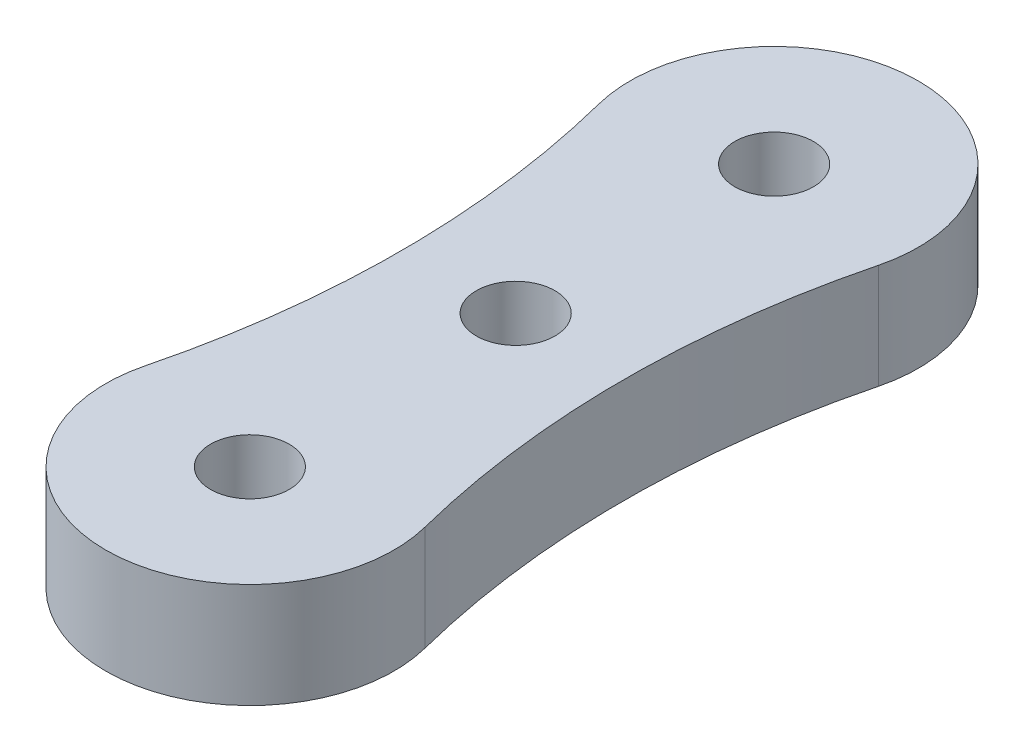
ISO-10303-21;
HEADER;
FILE_DESCRIPTION(('STEP AP214'),'2;1');
FILE_NAME('part.step','',(''),(''),'','','');
FILE_SCHEMA(('AUTOMOTIVE_DESIGN { 1 0 10303 214 1 1 1 1 }'));
ENDSEC;
DATA;
#1=APPLICATION_CONTEXT('core data for automotive mechanical design processes');
#2=APPLICATION_PROTOCOL_DEFINITION('international standard','automotive_design',2000,#1);
#3=PRODUCT_CONTEXT('',#1,'mechanical');
#4=PRODUCT('Part','Part','',(#3));
#5=PRODUCT_RELATED_PRODUCT_CATEGORY('part','',(#4));
#6=PRODUCT_DEFINITION_FORMATION('','',#4);
#7=PRODUCT_DEFINITION_CONTEXT('part definition',#1,'design');
#8=PRODUCT_DEFINITION('design','',#6,#7);
#9=PRODUCT_DEFINITION_SHAPE('','',#8);
#10=(LENGTH_UNIT() NAMED_UNIT(*) SI_UNIT(.MILLI.,.METRE.));
#11=(NAMED_UNIT(*) PLANE_ANGLE_UNIT() SI_UNIT($,.RADIAN.));
#12=(NAMED_UNIT(*) SI_UNIT($,.STERADIAN.) SOLID_ANGLE_UNIT());
#13=UNCERTAINTY_MEASURE_WITH_UNIT(LENGTH_MEASURE(1.E-05),#10,'distance_accuracy_value','');
#14=(GEOMETRIC_REPRESENTATION_CONTEXT(3) GLOBAL_UNCERTAINTY_ASSIGNED_CONTEXT((#13)) GLOBAL_UNIT_ASSIGNED_CONTEXT((#10,
#11,#12)) REPRESENTATION_CONTEXT('',''));
#15=CARTESIAN_POINT('',(0.,0.,0.));
#16=DIRECTION('',(0.,0.,1.));
#17=DIRECTION('',(1.,0.,0.));
#18=AXIS2_PLACEMENT_3D('',#15,#16,#17);
#19=CARTESIAN_POINT('',(-19.6875000000001,4.,-15.));
#20=DIRECTION('',(0.,1.,0.));
#21=DIRECTION('',(0.,0.,1.));
#22=AXIS2_PLACEMENT_3D('',#19,#20,#21);
#23=PLANE('',#22);
#24=CARTESIAN_POINT('',(0.,4.,0.));
#25=DIRECTION('',(0.,1.,0.));
#26=DIRECTION('',(0.,0.,1.));
#27=AXIS2_PLACEMENT_3D('',#24,#25,#26);
#28=CIRCLE('',#27,1.5);
#29=CARTESIAN_POINT('',(0.,4.,1.5));
#30=VERTEX_POINT('',#29);
#31=EDGE_CURVE('E117',#30,#30,#28,.T.);
#32=ORIENTED_EDGE('',*,*,#31,.F.);
#33=EDGE_LOOP('',(#32));
#34=FACE_BOUND('',#33,.T.);
#35=CARTESIAN_POINT('',(-39.3750000000002,4.,-10.));
#36=DIRECTION('',(0.,-1.,0.));
#37=DIRECTION('',(0.,0.,1.));
#38=AXIS2_PLACEMENT_3D('',#35,#36,#37);
#39=CIRCLE('',#38,35.1250000000002);
#40=CARTESIAN_POINT('',(-5.33076923076923,4.,-18.6461538461539));
#41=VERTEX_POINT('',#40);
#42=CARTESIAN_POINT('',(-5.33076923076922,4.,-1.35384615384615));
#43=VERTEX_POINT('',#42);
#44=EDGE_CURVE('E87',#41,#43,#39,.T.);
#45=ORIENTED_EDGE('',*,*,#44,.T.);
#46=CARTESIAN_POINT('',(0.,4.,0.));
#47=DIRECTION('',(0.,1.,0.));
#48=DIRECTION('',(0.,0.,1.));
#49=AXIS2_PLACEMENT_3D('',#46,#47,#48);
#50=CIRCLE('',#49,5.49999999999999);
#51=CARTESIAN_POINT('',(5.33076923076922,4.,-1.35384615384614));
#52=VERTEX_POINT('',#51);
#53=EDGE_CURVE('E82',#43,#52,#50,.T.);
#54=ORIENTED_EDGE('',*,*,#53,.T.);
#55=CARTESIAN_POINT('',(39.3750000000002,4.,-10.));
#56=DIRECTION('',(0.,-1.,0.));
#57=DIRECTION('',(0.,0.,1.));
#58=AXIS2_PLACEMENT_3D('',#55,#56,#57);
#59=CIRCLE('',#58,35.1250000000002);
#60=CARTESIAN_POINT('',(5.33076923076923,4.,-18.6461538461539));
#61=VERTEX_POINT('',#60);
#62=EDGE_CURVE('E85',#52,#61,#59,.T.);
#63=ORIENTED_EDGE('',*,*,#62,.T.);
#64=CARTESIAN_POINT('',(0.,4.,-20.));
#65=DIRECTION('',(0.,1.,0.));
#66=DIRECTION('',(0.,0.,1.));
#67=AXIS2_PLACEMENT_3D('',#64,#65,#66);
#68=CIRCLE('',#67,5.49999999999999);
#69=EDGE_CURVE('E52',#61,#41,#68,.T.);
#70=ORIENTED_EDGE('',*,*,#69,.T.);
#71=EDGE_LOOP('',(#45,#54,#63,#70));
#72=FACE_BOUND('',#71,.T.);
#73=CARTESIAN_POINT('',(0.,4.,-10.14));
#74=DIRECTION('',(0.,1.,0.));
#75=DIRECTION('',(0.,0.,1.));
#76=AXIS2_PLACEMENT_3D('',#73,#74,#75);
#77=CIRCLE('',#76,1.5);
#78=CARTESIAN_POINT('',(0.,4.,-8.64));
#79=VERTEX_POINT('',#78);
#80=EDGE_CURVE('E102',#79,#79,#77,.T.);
#81=ORIENTED_EDGE('',*,*,#80,.F.);
#82=EDGE_LOOP('',(#81));
#83=FACE_BOUND('',#82,.T.);
#84=CARTESIAN_POINT('',(0.,4.,-20.));
#85=DIRECTION('',(0.,1.,0.));
#86=DIRECTION('',(0.,0.,1.));
#87=AXIS2_PLACEMENT_3D('',#84,#85,#86);
#88=CIRCLE('',#87,1.5);
#89=CARTESIAN_POINT('',(0.,4.,-18.5));
#90=VERTEX_POINT('',#89);
#91=EDGE_CURVE('E123',#90,#90,#88,.T.);
#92=ORIENTED_EDGE('',*,*,#91,.F.);
#93=EDGE_LOOP('',(#92));
#94=FACE_BOUND('',#93,.T.);
#95=ADVANCED_FACE('F35',(#34,#72,#83,#94),#23,.T.);
#96=CARTESIAN_POINT('',(-19.6875000000001,0.,-15.));
#97=DIRECTION('',(0.,1.,0.));
#98=DIRECTION('',(0.,0.,1.));
#99=AXIS2_PLACEMENT_3D('',#96,#97,#98);
#100=PLANE('',#99);
#101=CARTESIAN_POINT('',(-39.3750000000002,0.,-10.));
#102=DIRECTION('',(0.,-1.,0.));
#103=DIRECTION('',(0.,0.,1.));
#104=AXIS2_PLACEMENT_3D('',#101,#102,#103);
#105=CIRCLE('',#104,35.1250000000002);
#106=CARTESIAN_POINT('',(-5.33076923076923,0.,-18.6461538461539));
#107=VERTEX_POINT('',#106);
#108=CARTESIAN_POINT('',(-5.33076923076922,0.,-1.35384615384615));
#109=VERTEX_POINT('',#108);
#110=EDGE_CURVE('E99',#107,#109,#105,.T.);
#111=ORIENTED_EDGE('',*,*,#110,.F.);
#112=CARTESIAN_POINT('',(0.,0.,-20.));
#113=DIRECTION('',(0.,1.,0.));
#114=DIRECTION('',(0.,0.,1.));
#115=AXIS2_PLACEMENT_3D('',#112,#113,#114);
#116=CIRCLE('',#115,5.49999999999999);
#117=CARTESIAN_POINT('',(5.33076923076923,0.,-18.6461538461539));
#118=VERTEX_POINT('',#117);
#119=EDGE_CURVE('E75',#118,#107,#116,.T.);
#120=ORIENTED_EDGE('',*,*,#119,.F.);
#121=CARTESIAN_POINT('',(39.3750000000002,0.,-10.));
#122=DIRECTION('',(0.,-1.,0.));
#123=DIRECTION('',(0.,0.,1.));
#124=AXIS2_PLACEMENT_3D('',#121,#122,#123);
#125=CIRCLE('',#124,35.1250000000002);
#126=CARTESIAN_POINT('',(5.33076923076922,0.,-1.35384615384614));
#127=VERTEX_POINT('',#126);
#128=EDGE_CURVE('E69',#127,#118,#125,.T.);
#129=ORIENTED_EDGE('',*,*,#128,.F.);
#130=CARTESIAN_POINT('',(0.,0.,0.));
#131=DIRECTION('',(0.,1.,0.));
#132=DIRECTION('',(0.,0.,1.));
#133=AXIS2_PLACEMENT_3D('',#130,#131,#132);
#134=CIRCLE('',#133,5.49999999999999);
#135=EDGE_CURVE('E91',#109,#127,#134,.T.);
#136=ORIENTED_EDGE('',*,*,#135,.F.);
#137=EDGE_LOOP('',(#111,#120,#129,#136));
#138=FACE_BOUND('',#137,.T.);
#139=CARTESIAN_POINT('',(0.,0.,-10.14));
#140=DIRECTION('',(0.,1.,0.));
#141=DIRECTION('',(0.,0.,1.));
#142=AXIS2_PLACEMENT_3D('',#139,#140,#141);
#143=CIRCLE('',#142,1.5);
#144=CARTESIAN_POINT('',(0.,0.,-8.64));
#145=VERTEX_POINT('',#144);
#146=EDGE_CURVE('E114',#145,#145,#143,.T.);
#147=ORIENTED_EDGE('',*,*,#146,.T.);
#148=EDGE_LOOP('',(#147));
#149=FACE_BOUND('',#148,.T.);
#150=CARTESIAN_POINT('',(0.,0.,0.));
#151=DIRECTION('',(0.,1.,0.));
#152=DIRECTION('',(0.,0.,1.));
#153=AXIS2_PLACEMENT_3D('',#150,#151,#152);
#154=CIRCLE('',#153,1.5);
#155=CARTESIAN_POINT('',(0.,0.,1.5));
#156=VERTEX_POINT('',#155);
#157=EDGE_CURVE('E120',#156,#156,#154,.T.);
#158=ORIENTED_EDGE('',*,*,#157,.T.);
#159=EDGE_LOOP('',(#158));
#160=FACE_BOUND('',#159,.T.);
#161=CARTESIAN_POINT('',(0.,0.,-20.));
#162=DIRECTION('',(0.,1.,0.));
#163=DIRECTION('',(0.,0.,1.));
#164=AXIS2_PLACEMENT_3D('',#161,#162,#163);
#165=CIRCLE('',#164,1.5);
#166=CARTESIAN_POINT('',(0.,0.,-18.5));
#167=VERTEX_POINT('',#166);
#168=EDGE_CURVE('E126',#167,#167,#165,.T.);
#169=ORIENTED_EDGE('',*,*,#168,.T.);
#170=EDGE_LOOP('',(#169));
#171=FACE_BOUND('',#170,.T.);
#172=ADVANCED_FACE('F110',(#138,#149,#160,#171),#100,.F.);
#173=CARTESIAN_POINT('',(-39.3750000000002,4.,-10.));
#174=DIRECTION('',(0.,-1.,0.));
#175=DIRECTION('',(0.,0.,-1.));
#176=AXIS2_PLACEMENT_3D('',#173,#174,#175);
#177=CYLINDRICAL_SURFACE('',#176,35.1250000000002);
#178=ORIENTED_EDGE('',*,*,#110,.T.);
#179=DIRECTION('',(0.,-1.,0.));
#180=VECTOR('',#179,1.);
#181=CARTESIAN_POINT('',(-5.33076923076922,4.,-1.35384615384615));
#182=LINE('',#181,#180);
#183=EDGE_CURVE('E11',#43,#109,#182,.T.);
#184=ORIENTED_EDGE('',*,*,#183,.F.);
#185=ORIENTED_EDGE('',*,*,#44,.F.);
#186=DIRECTION('',(0.,-1.,0.));
#187=VECTOR('',#186,1.);
#188=CARTESIAN_POINT('',(-5.33076923076923,4.,-18.6461538461539));
#189=LINE('',#188,#187);
#190=EDGE_CURVE('E95',#41,#107,#189,.T.);
#191=ORIENTED_EDGE('',*,*,#190,.T.);
#192=EDGE_LOOP('',(#178,#184,#185,#191));
#193=FACE_BOUND('',#192,.T.);
#194=ADVANCED_FACE('F37',(#193),#177,.F.);
#195=CARTESIAN_POINT('',(0.,4.,0.));
#196=DIRECTION('',(0.,-1.,0.));
#197=DIRECTION('',(0.,0.,-1.));
#198=AXIS2_PLACEMENT_3D('',#195,#196,#197);
#199=CYLINDRICAL_SURFACE('',#198,5.49999999999999);
#200=ORIENTED_EDGE('',*,*,#135,.T.);
#201=DIRECTION('',(0.,-1.,0.));
#202=VECTOR('',#201,1.);
#203=CARTESIAN_POINT('',(5.33076923076922,4.,-1.35384615384614));
#204=LINE('',#203,#202);
#205=EDGE_CURVE('E44',#52,#127,#204,.T.);
#206=ORIENTED_EDGE('',*,*,#205,.F.);
#207=ORIENTED_EDGE('',*,*,#53,.F.);
#208=ORIENTED_EDGE('',*,*,#183,.T.);
#209=EDGE_LOOP('',(#200,#206,#207,#208));
#210=FACE_BOUND('',#209,.T.);
#211=ADVANCED_FACE('F90',(#210),#199,.T.);
#212=CARTESIAN_POINT('',(39.3750000000002,4.,-10.));
#213=DIRECTION('',(0.,-1.,0.));
#214=DIRECTION('',(0.,0.,-1.));
#215=AXIS2_PLACEMENT_3D('',#212,#213,#214);
#216=CYLINDRICAL_SURFACE('',#215,35.1250000000002);
#217=ORIENTED_EDGE('',*,*,#128,.T.);
#218=DIRECTION('',(0.,-1.,0.));
#219=VECTOR('',#218,1.);
#220=CARTESIAN_POINT('',(5.33076923076923,4.,-18.6461538461539));
#221=LINE('',#220,#219);
#222=EDGE_CURVE('E92',#61,#118,#221,.T.);
#223=ORIENTED_EDGE('',*,*,#222,.F.);
#224=ORIENTED_EDGE('',*,*,#62,.F.);
#225=ORIENTED_EDGE('',*,*,#205,.T.);
#226=EDGE_LOOP('',(#217,#223,#224,#225));
#227=FACE_BOUND('',#226,.T.);
#228=ADVANCED_FACE('F93',(#227),#216,.F.);
#229=CARTESIAN_POINT('',(0.,4.,-20.));
#230=DIRECTION('',(0.,-1.,0.));
#231=DIRECTION('',(0.,0.,-1.));
#232=AXIS2_PLACEMENT_3D('',#229,#230,#231);
#233=CYLINDRICAL_SURFACE('',#232,5.49999999999999);
#234=ORIENTED_EDGE('',*,*,#119,.T.);
#235=ORIENTED_EDGE('',*,*,#190,.F.);
#236=ORIENTED_EDGE('',*,*,#69,.F.);
#237=ORIENTED_EDGE('',*,*,#222,.T.);
#238=EDGE_LOOP('',(#234,#235,#236,#237));
#239=FACE_BOUND('',#238,.T.);
#240=ADVANCED_FACE('F107',(#239),#233,.T.);
#241=CARTESIAN_POINT('',(0.,4.,-10.14));
#242=DIRECTION('',(0.,-1.,0.));
#243=DIRECTION('',(0.,0.,-1.));
#244=AXIS2_PLACEMENT_3D('',#241,#242,#243);
#245=CYLINDRICAL_SURFACE('',#244,1.5);
#246=ORIENTED_EDGE('',*,*,#80,.T.);
#247=EDGE_LOOP('',(#246));
#248=FACE_BOUND('',#247,.T.);
#249=ORIENTED_EDGE('',*,*,#146,.F.);
#250=EDGE_LOOP('',(#249));
#251=FACE_BOUND('',#250,.T.);
#252=ADVANCED_FACE('F144',(#248,#251),#245,.F.);
#253=CARTESIAN_POINT('',(0.,4.,0.));
#254=DIRECTION('',(0.,-1.,0.));
#255=DIRECTION('',(0.,0.,-1.));
#256=AXIS2_PLACEMENT_3D('',#253,#254,#255);
#257=CYLINDRICAL_SURFACE('',#256,1.5);
#258=ORIENTED_EDGE('',*,*,#31,.T.);
#259=EDGE_LOOP('',(#258));
#260=FACE_BOUND('',#259,.T.);
#261=ORIENTED_EDGE('',*,*,#157,.F.);
#262=EDGE_LOOP('',(#261));
#263=FACE_BOUND('',#262,.T.);
#264=ADVANCED_FACE('F190',(#260,#263),#257,.F.);
#265=CARTESIAN_POINT('',(0.,4.,-20.));
#266=DIRECTION('',(0.,-1.,0.));
#267=DIRECTION('',(0.,0.,-1.));
#268=AXIS2_PLACEMENT_3D('',#265,#266,#267);
#269=CYLINDRICAL_SURFACE('',#268,1.5);
#270=ORIENTED_EDGE('',*,*,#91,.T.);
#271=EDGE_LOOP('',(#270));
#272=FACE_BOUND('',#271,.T.);
#273=ORIENTED_EDGE('',*,*,#168,.F.);
#274=EDGE_LOOP('',(#273));
#275=FACE_BOUND('',#274,.T.);
#276=ADVANCED_FACE('F132',(#272,#275),#269,.F.);
#277=CLOSED_SHELL('',(#95,#172,#194,#211,#228,#240,#252,#264,#276));
#278=MANIFOLD_SOLID_BREP('B2',#277);
#279=ADVANCED_BREP_SHAPE_REPRESENTATION('',(#18,#278),#14);
#280=SHAPE_DEFINITION_REPRESENTATION(#9,#279);
ENDSEC;
END-ISO-10303-21;
